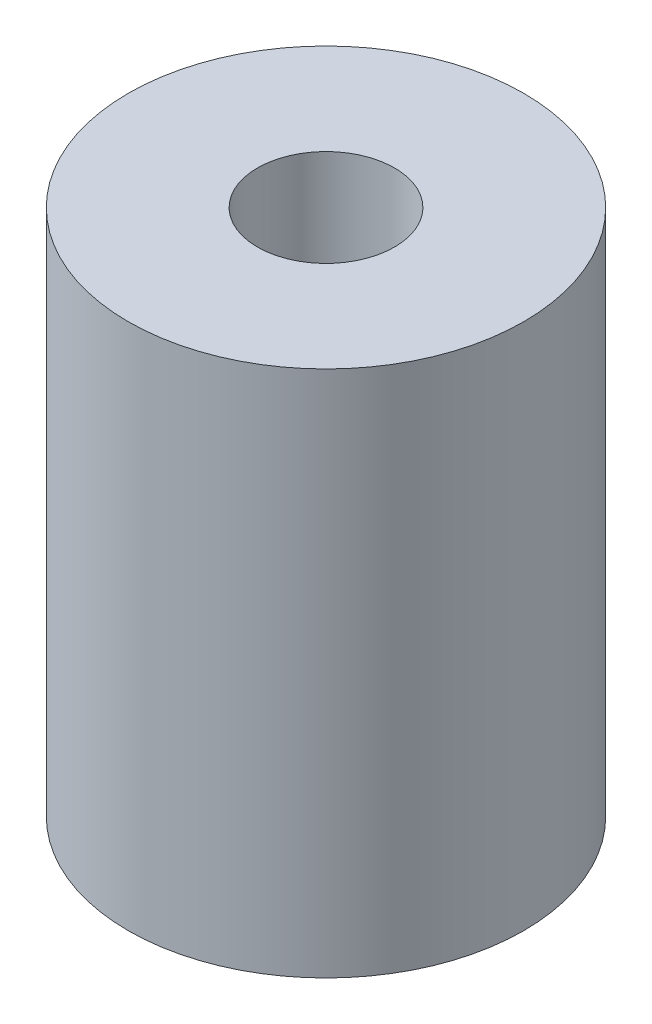
ISO-10303-21;
HEADER;
FILE_DESCRIPTION(('STEP AP214'),'2;1');
FILE_NAME('part.step','',(''),(''),'','','');
FILE_SCHEMA(('AUTOMOTIVE_DESIGN { 1 0 10303 214 1 1 1 1 }'));
ENDSEC;
DATA;
#1=APPLICATION_CONTEXT('core data for automotive mechanical design processes');
#2=APPLICATION_PROTOCOL_DEFINITION('international standard','automotive_design',2000,#1);
#3=PRODUCT_CONTEXT('',#1,'mechanical');
#4=PRODUCT('Part','Part','',(#3));
#5=PRODUCT_RELATED_PRODUCT_CATEGORY('part','',(#4));
#6=PRODUCT_DEFINITION_FORMATION('','',#4);
#7=PRODUCT_DEFINITION_CONTEXT('part definition',#1,'design');
#8=PRODUCT_DEFINITION('design','',#6,#7);
#9=PRODUCT_DEFINITION_SHAPE('','',#8);
#10=(LENGTH_UNIT() NAMED_UNIT(*) SI_UNIT(.MILLI.,.METRE.));
#11=(NAMED_UNIT(*) PLANE_ANGLE_UNIT() SI_UNIT($,.RADIAN.));
#12=(NAMED_UNIT(*) SI_UNIT($,.STERADIAN.) SOLID_ANGLE_UNIT());
#13=UNCERTAINTY_MEASURE_WITH_UNIT(LENGTH_MEASURE(1.E-05),#10,'distance_accuracy_value','');
#14=(GEOMETRIC_REPRESENTATION_CONTEXT(3) GLOBAL_UNCERTAINTY_ASSIGNED_CONTEXT((#13)) GLOBAL_UNIT_ASSIGNED_CONTEXT((#10,
#11,#12)) REPRESENTATION_CONTEXT('',''));
#15=CARTESIAN_POINT('',(0.,0.,0.));
#16=DIRECTION('',(0.,0.,1.));
#17=DIRECTION('',(1.,0.,0.));
#18=AXIS2_PLACEMENT_3D('',#15,#16,#17);
#19=CARTESIAN_POINT('',(0.,25.4,0.));
#20=DIRECTION('',(0.,1.,0.));
#21=DIRECTION('',(0.,0.,1.));
#22=AXIS2_PLACEMENT_3D('',#19,#20,#21);
#23=PLANE('',#22);
#24=CARTESIAN_POINT('',(0.,25.4,0.));
#25=DIRECTION('',(0.,1.,0.));
#26=DIRECTION('',(0.,0.,1.));
#27=AXIS2_PLACEMENT_3D('',#24,#25,#26);
#28=CIRCLE('',#27,9.525);
#29=CARTESIAN_POINT('',(0.,25.4,9.525));
#30=VERTEX_POINT('',#29);
#31=EDGE_CURVE('E10',#30,#30,#28,.T.);
#32=ORIENTED_EDGE('',*,*,#31,.T.);
#33=EDGE_LOOP('',(#32));
#34=FACE_BOUND('',#33,.T.);
#35=CARTESIAN_POINT('',(0.,25.4,0.));
#36=DIRECTION('',(0.,1.,0.));
#37=DIRECTION('',(0.,0.,1.));
#38=AXIS2_PLACEMENT_3D('',#35,#36,#37);
#39=CIRCLE('',#38,3.302);
#40=CARTESIAN_POINT('',(0.,25.4,3.302));
#41=VERTEX_POINT('',#40);
#42=EDGE_CURVE('E42',#41,#41,#39,.T.);
#43=ORIENTED_EDGE('',*,*,#42,.F.);
#44=EDGE_LOOP('',(#43));
#45=FACE_BOUND('',#44,.T.);
#46=ADVANCED_FACE('F31',(#34,#45),#23,.T.);
#47=CARTESIAN_POINT('',(0.,0.,0.));
#48=DIRECTION('',(0.,1.,0.));
#49=DIRECTION('',(0.,0.,1.));
#50=AXIS2_PLACEMENT_3D('',#47,#48,#49);
#51=PLANE('',#50);
#52=CARTESIAN_POINT('',(0.,0.,0.));
#53=DIRECTION('',(0.,1.,0.));
#54=DIRECTION('',(0.,0.,1.));
#55=AXIS2_PLACEMENT_3D('',#52,#53,#54);
#56=CIRCLE('',#55,9.525);
#57=CARTESIAN_POINT('',(0.,0.,9.525));
#58=VERTEX_POINT('',#57);
#59=EDGE_CURVE('E35',#58,#58,#56,.T.);
#60=ORIENTED_EDGE('',*,*,#59,.F.);
#61=EDGE_LOOP('',(#60));
#62=FACE_BOUND('',#61,.T.);
#63=CARTESIAN_POINT('',(0.,0.,0.));
#64=DIRECTION('',(0.,1.,0.));
#65=DIRECTION('',(0.,0.,1.));
#66=AXIS2_PLACEMENT_3D('',#63,#64,#65);
#67=CIRCLE('',#66,3.302);
#68=CARTESIAN_POINT('',(0.,0.,3.302));
#69=VERTEX_POINT('',#68);
#70=EDGE_CURVE('E44',#69,#69,#67,.T.);
#71=ORIENTED_EDGE('',*,*,#70,.T.);
#72=EDGE_LOOP('',(#71));
#73=FACE_BOUND('',#72,.T.);
#74=ADVANCED_FACE('F54',(#62,#73),#51,.F.);
#75=CARTESIAN_POINT('',(0.,25.4,0.));
#76=DIRECTION('',(0.,-1.,0.));
#77=DIRECTION('',(0.,0.,-1.));
#78=AXIS2_PLACEMENT_3D('',#75,#76,#77);
#79=CYLINDRICAL_SURFACE('',#78,9.525);
#80=ORIENTED_EDGE('',*,*,#31,.F.);
#81=EDGE_LOOP('',(#80));
#82=FACE_BOUND('',#81,.T.);
#83=ORIENTED_EDGE('',*,*,#59,.T.);
#84=EDGE_LOOP('',(#83));
#85=FACE_BOUND('',#84,.T.);
#86=ADVANCED_FACE('F33',(#82,#85),#79,.T.);
#87=CARTESIAN_POINT('',(0.,25.4,0.));
#88=DIRECTION('',(0.,-1.,0.));
#89=DIRECTION('',(0.,0.,-1.));
#90=AXIS2_PLACEMENT_3D('',#87,#88,#89);
#91=CYLINDRICAL_SURFACE('',#90,3.302);
#92=ORIENTED_EDGE('',*,*,#42,.T.);
#93=EDGE_LOOP('',(#92));
#94=FACE_BOUND('',#93,.T.);
#95=ORIENTED_EDGE('',*,*,#70,.F.);
#96=EDGE_LOOP('',(#95));
#97=FACE_BOUND('',#96,.T.);
#98=ADVANCED_FACE('F50',(#94,#97),#91,.F.);
#99=CLOSED_SHELL('',(#46,#74,#86,#98));
#100=MANIFOLD_SOLID_BREP('B2',#99);
#101=ADVANCED_BREP_SHAPE_REPRESENTATION('',(#18,#100),#14);
#102=SHAPE_DEFINITION_REPRESENTATION(#9,#101);
ENDSEC;
END-ISO-10303-21;
